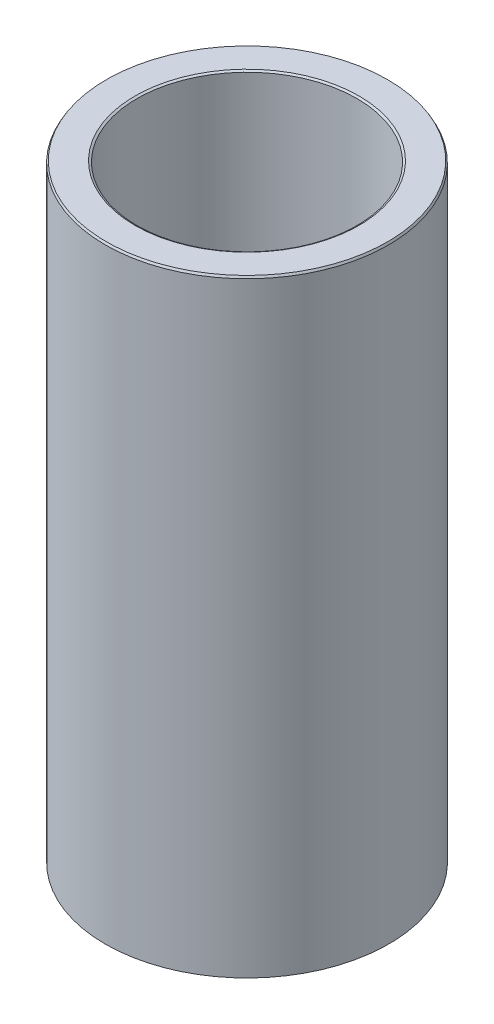
ISO-10303-21;
HEADER;
FILE_DESCRIPTION(('STEP AP214'),'2;1');
FILE_NAME('part.step','',(''),(''),'','','');
FILE_SCHEMA(('AUTOMOTIVE_DESIGN { 1 0 10303 214 1 1 1 1 }'));
ENDSEC;
DATA;
#1=APPLICATION_CONTEXT('core data for automotive mechanical design processes');
#2=APPLICATION_PROTOCOL_DEFINITION('international standard','automotive_design',2000,#1);
#3=PRODUCT_CONTEXT('',#1,'mechanical');
#4=PRODUCT('Part','Part','',(#3));
#5=PRODUCT_RELATED_PRODUCT_CATEGORY('part','',(#4));
#6=PRODUCT_DEFINITION_FORMATION('','',#4);
#7=PRODUCT_DEFINITION_CONTEXT('part definition',#1,'design');
#8=PRODUCT_DEFINITION('design','',#6,#7);
#9=PRODUCT_DEFINITION_SHAPE('','',#8);
#10=(LENGTH_UNIT() NAMED_UNIT(*) SI_UNIT(.MILLI.,.METRE.));
#11=(NAMED_UNIT(*) PLANE_ANGLE_UNIT() SI_UNIT($,.RADIAN.));
#12=(NAMED_UNIT(*) SI_UNIT($,.STERADIAN.) SOLID_ANGLE_UNIT());
#13=UNCERTAINTY_MEASURE_WITH_UNIT(LENGTH_MEASURE(1.E-05),#10,'distance_accuracy_value','');
#14=(GEOMETRIC_REPRESENTATION_CONTEXT(3) GLOBAL_UNCERTAINTY_ASSIGNED_CONTEXT((#13)) GLOBAL_UNIT_ASSIGNED_CONTEXT((#10,
#11,#12)) REPRESENTATION_CONTEXT('',''));
#15=CARTESIAN_POINT('',(0.,0.,0.));
#16=DIRECTION('',(0.,0.,1.));
#17=DIRECTION('',(1.,0.,0.));
#18=AXIS2_PLACEMENT_3D('',#15,#16,#17);
#19=CARTESIAN_POINT('',(0.,64.4296451727049,0.));
#20=DIRECTION('',(0.,-1.,0.));
#21=DIRECTION('',(0.,0.,-1.));
#22=AXIS2_PLACEMENT_3D('',#19,#20,#21);
#23=CYLINDRICAL_SURFACE('',#22,15.);
#24=CARTESIAN_POINT('',(0.,0.125010479312071,0.));
#25=DIRECTION('',(0.,1.,0.));
#26=DIRECTION('',(0.,0.,1.));
#27=AXIS2_PLACEMENT_3D('',#24,#25,#26);
#28=CIRCLE('',#27,15.);
#29=CARTESIAN_POINT('',(0.,0.125010479312071,15.));
#30=VERTEX_POINT('',#29);
#31=EDGE_CURVE('E10',#30,#30,#28,.T.);
#32=ORIENTED_EDGE('',*,*,#31,.T.);
#33=EDGE_LOOP('',(#32));
#34=FACE_BOUND('',#33,.T.);
#35=CARTESIAN_POINT('',(0.,64.2131206710579,0.));
#36=DIRECTION('',(0.,1.,0.));
#37=DIRECTION('',(0.,0.,1.));
#38=AXIS2_PLACEMENT_3D('',#35,#36,#37);
#39=CIRCLE('',#38,15.);
#40=CARTESIAN_POINT('',(0.,64.2131206710579,-15.));
#41=VERTEX_POINT('',#40);
#42=EDGE_CURVE('E50',#41,#41,#39,.F.);
#43=ORIENTED_EDGE('',*,*,#42,.T.);
#44=EDGE_LOOP('',(#43));
#45=FACE_BOUND('',#44,.T.);
#46=ADVANCED_FACE('F39',(#34,#45),#23,.T.);
#47=CARTESIAN_POINT('',(0.,64.4296451727049,0.));
#48=DIRECTION('',(0.,1.,0.));
#49=DIRECTION('',(0.,0.,1.));
#50=AXIS2_PLACEMENT_3D('',#47,#48,#49);
#51=PLANE('',#50);
#52=CARTESIAN_POINT('',(0.,64.4296451727049,0.));
#53=DIRECTION('',(0.,1.,0.));
#54=DIRECTION('',(0.,0.,1.));
#55=AXIS2_PLACEMENT_3D('',#52,#53,#54);
#56=CIRCLE('',#55,11.8623897292429);
#57=CARTESIAN_POINT('',(0.,64.4296451727049,11.8623897292429));
#58=VERTEX_POINT('',#57);
#59=EDGE_CURVE('E58',#58,#58,#56,.F.);
#60=ORIENTED_EDGE('',*,*,#59,.T.);
#61=EDGE_LOOP('',(#60));
#62=FACE_BOUND('',#61,.T.);
#63=CARTESIAN_POINT('',(0.,64.4296451727049,0.));
#64=DIRECTION('',(0.,1.,0.));
#65=DIRECTION('',(0.,0.,1.));
#66=AXIS2_PLACEMENT_3D('',#63,#64,#65);
#67=CIRCLE('',#66,14.8749895206879);
#68=CARTESIAN_POINT('',(0.,64.4296451727049,-14.8749895206879));
#69=VERTEX_POINT('',#68);
#70=EDGE_CURVE('E61',#69,#69,#67,.T.);
#71=ORIENTED_EDGE('',*,*,#70,.T.);
#72=EDGE_LOOP('',(#71));
#73=FACE_BOUND('',#72,.T.);
#74=ADVANCED_FACE('F88',(#62,#73),#51,.T.);
#75=CARTESIAN_POINT('',(0.,0.,0.));
#76=DIRECTION('',(0.,1.,0.));
#77=DIRECTION('',(0.,0.,1.));
#78=AXIS2_PLACEMENT_3D('',#75,#76,#77);
#79=PLANE('',#78);
#80=CARTESIAN_POINT('',(0.,0.,0.));
#81=DIRECTION('',(0.,1.,0.));
#82=DIRECTION('',(0.,0.,1.));
#83=AXIS2_PLACEMENT_3D('',#80,#81,#82);
#84=CIRCLE('',#83,11.7708757069079);
#85=CARTESIAN_POINT('',(0.,0.,-11.7708757069079));
#86=VERTEX_POINT('',#85);
#87=EDGE_CURVE('E51',#86,#86,#84,.T.);
#88=ORIENTED_EDGE('',*,*,#87,.T.);
#89=EDGE_LOOP('',(#88));
#90=FACE_BOUND('',#89,.T.);
#91=CARTESIAN_POINT('',(0.,0.,0.));
#92=DIRECTION('',(0.,1.,0.));
#93=DIRECTION('',(0.,0.,1.));
#94=AXIS2_PLACEMENT_3D('',#91,#92,#93);
#95=CIRCLE('',#94,14.783475498353);
#96=CARTESIAN_POINT('',(0.,0.,14.783475498353));
#97=VERTEX_POINT('',#96);
#98=EDGE_CURVE('E54',#97,#97,#95,.F.);
#99=ORIENTED_EDGE('',*,*,#98,.T.);
#100=EDGE_LOOP('',(#99));
#101=FACE_BOUND('',#100,.T.);
#102=ADVANCED_FACE('F83',(#90,#101),#79,.F.);
#103=CARTESIAN_POINT('',(0.,64.4296451727049,0.));
#104=DIRECTION('',(0.,-1.,0.));
#105=DIRECTION('',(0.,0.,-1.));
#106=AXIS2_PLACEMENT_3D('',#103,#104,#105);
#107=CYLINDRICAL_SURFACE('',#106,11.6458652275958);
#108=CARTESIAN_POINT('',(0.,64.3046346933928,0.));
#109=DIRECTION('',(0.,1.,0.));
#110=DIRECTION('',(0.,0.,1.));
#111=AXIS2_PLACEMENT_3D('',#108,#109,#110);
#112=CIRCLE('',#111,11.6458652275958);
#113=CARTESIAN_POINT('',(0.,64.3046346933928,11.6458652275958));
#114=VERTEX_POINT('',#113);
#115=EDGE_CURVE('E67',#114,#114,#112,.T.);
#116=ORIENTED_EDGE('',*,*,#115,.T.);
#117=EDGE_LOOP('',(#116));
#118=FACE_BOUND('',#117,.T.);
#119=CARTESIAN_POINT('',(0.,0.216524501647053,0.));
#120=DIRECTION('',(0.,1.,0.));
#121=DIRECTION('',(0.,0.,1.));
#122=AXIS2_PLACEMENT_3D('',#119,#120,#121);
#123=CIRCLE('',#122,11.6458652275958);
#124=CARTESIAN_POINT('',(0.,0.216524501647053,-11.6458652275958));
#125=VERTEX_POINT('',#124);
#126=EDGE_CURVE('E69',#125,#125,#123,.F.);
#127=ORIENTED_EDGE('',*,*,#126,.T.);
#128=EDGE_LOOP('',(#127));
#129=FACE_BOUND('',#128,.T.);
#130=ADVANCED_FACE('F71',(#118,#129),#107,.F.);
#131=CARTESIAN_POINT('',(0.,64.3046346933928,0.));
#132=DIRECTION('',(0.,1.,0.));
#133=DIRECTION('',(0.,0.,1.));
#134=AXIS2_PLACEMENT_3D('',#131,#132,#133);
#135=CONICAL_SURFACE('',#134,11.6458652275958,1.04719755119657);
#136=ORIENTED_EDGE('',*,*,#59,.F.);
#137=EDGE_LOOP('',(#136));
#138=FACE_BOUND('',#137,.T.);
#139=ORIENTED_EDGE('',*,*,#115,.F.);
#140=EDGE_LOOP('',(#139));
#141=FACE_BOUND('',#140,.T.);
#142=ADVANCED_FACE('F77',(#138,#141),#135,.F.);
#143=CARTESIAN_POINT('',(0.,0.,0.));
#144=DIRECTION('',(0.,-1.,0.));
#145=DIRECTION('',(0.,0.,-1.));
#146=AXIS2_PLACEMENT_3D('',#143,#144,#145);
#147=CONICAL_SURFACE('',#146,11.7708757069079,0.523598775598295);
#148=CARTESIAN_POINT('',(0.,0.216524501647053,-11.6458652275958));
#149=CARTESIAN_POINT('',(0.,0.214269038088229,-11.6471674200887));
#150=CARTESIAN_POINT('',(0.,0.212013574529406,-11.6484696125815));
#151=CARTESIAN_POINT('',(0.,0.207502647411759,-11.6510739975672));
#152=CARTESIAN_POINT('',(0.,0.205247183852936,-11.65237619006));
#153=CARTESIAN_POINT('',(0.,0.200736256735289,-11.6549805750457));
#154=CARTESIAN_POINT('',(0.,0.198480793176465,-11.6562827675385));
#155=CARTESIAN_POINT('',(0.,0.193969866058818,-11.6588871525242));
#156=CARTESIAN_POINT('',(0.,0.191714402499995,-11.660189345017));
#157=CARTESIAN_POINT('',(0.,0.187203475382348,-11.6627937300027));
#158=CARTESIAN_POINT('',(0.,0.184948011823524,-11.6640959224955));
#159=CARTESIAN_POINT('',(0.,0.180437084705877,-11.6667003074812));
#160=CARTESIAN_POINT('',(0.,0.178181621147054,-11.668002499974));
#161=CARTESIAN_POINT('',(0.,0.173670694029407,-11.6706068849597));
#162=CARTESIAN_POINT('',(0.,0.171415230470584,-11.6719090774525));
#163=CARTESIAN_POINT('',(0.,0.166904303352937,-11.6745134624382));
#164=CARTESIAN_POINT('',(0.,0.164648839794113,-11.675815654931));
#165=CARTESIAN_POINT('',(0.,0.160137912676466,-11.6784200399167));
#166=CARTESIAN_POINT('',(0.,0.157882449117643,-11.6797222324095));
#167=CARTESIAN_POINT('',(0.,0.153371521999996,-11.6823266173952));
#168=CARTESIAN_POINT('',(0.,0.151116058441172,-11.683628809888));
#169=CARTESIAN_POINT('',(0.,0.146605131323525,-11.6862331948737));
#170=CARTESIAN_POINT('',(0.,0.144349667764702,-11.6875353873665));
#171=CARTESIAN_POINT('',(0.,0.139838740647055,-11.6901397723522));
#172=CARTESIAN_POINT('',(0.,0.137583277088232,-11.691441964845));
#173=CARTESIAN_POINT('',(0.,0.133072349970585,-11.6940463498307));
#174=CARTESIAN_POINT('',(0.,0.130816886411761,-11.6953485423235));
#175=CARTESIAN_POINT('',(0.,0.126305959294114,-11.6979529273092));
#176=CARTESIAN_POINT('',(0.,0.124050495735291,-11.699255119802));
#177=CARTESIAN_POINT('',(0.,0.119539568617644,-11.7018595047877));
#178=CARTESIAN_POINT('',(0.,0.11728410505882,-11.7031616972805));
#179=CARTESIAN_POINT('',(0.,0.112773177941173,-11.7057660822662));
#180=CARTESIAN_POINT('',(0.,0.11051771438235,-11.707068274759));
#181=CARTESIAN_POINT('',(0.,0.106006787264703,-11.7096726597447));
#182=CARTESIAN_POINT('',(0.,0.10375132370588,-11.7109748522375));
#183=CARTESIAN_POINT('',(0.,0.0992403965882326,-11.7135792372232));
#184=CARTESIAN_POINT('',(0.,0.0969849330294091,-11.7148814297161));
#185=CARTESIAN_POINT('',(0.,0.0924740059117622,-11.7174858147017));
#186=CARTESIAN_POINT('',(0.,0.0902185423529387,-11.7187880071946));
#187=CARTESIAN_POINT('',(0.,0.0857076152352918,-11.7213923921802));
#188=CARTESIAN_POINT('',(0.,0.0834521516764683,-11.7226945846731));
#189=CARTESIAN_POINT('',(0.,0.0789412245588214,-11.7252989696587));
#190=CARTESIAN_POINT('',(0.,0.0766857609999979,-11.7266011621516));
#191=CARTESIAN_POINT('',(0.,0.072174833882351,-11.7292055471372));
#192=CARTESIAN_POINT('',(0.,0.0699193703235275,-11.7305077396301));
#193=CARTESIAN_POINT('',(0.,0.0654084432058805,-11.7331121246157));
#194=CARTESIAN_POINT('',(0.,0.0631529796470569,-11.7344143171086));
#195=CARTESIAN_POINT('',(0.,0.0586420525294101,-11.7370187020942));
#196=CARTESIAN_POINT('',(0.,0.0563865889705868,-11.7383208945871));
#197=CARTESIAN_POINT('',(0.,0.0518756618529399,-11.7409252795727));
#198=CARTESIAN_POINT('',(0.,0.0496201982941163,-11.7422274720656));
#199=CARTESIAN_POINT('',(0.,0.0451092711764693,-11.7448318570512));
#200=CARTESIAN_POINT('',(0.,0.0428538076176459,-11.7461340495441));
#201=CARTESIAN_POINT('',(0.,0.038342880499999,-11.7487384345297));
#202=CARTESIAN_POINT('',(0.,0.0360874169411755,-11.7500406270226));
#203=CARTESIAN_POINT('',(0.,0.0315764898235285,-11.7526450120082));
#204=CARTESIAN_POINT('',(0.,0.0293210262647051,-11.7539472045011));
#205=CARTESIAN_POINT('',(0.,0.0248100991470581,-11.7565515894867));
#206=CARTESIAN_POINT('',(0.,0.0225546355882347,-11.7578537819796));
#207=CARTESIAN_POINT('',(0.,0.0180437084705877,-11.7604581669652));
#208=CARTESIAN_POINT('',(0.,0.0157882449117643,-11.7617603594581));
#209=CARTESIAN_POINT('',(0.,0.0112773177941173,-11.7643647444437));
#210=CARTESIAN_POINT('',(0.,0.00902185423529387,-11.7656669369366));
#211=CARTESIAN_POINT('',(0.,0.00451092711764694,-11.7682713219222));
#212=CARTESIAN_POINT('',(0.,0.00225546355882347,-11.7695735144151));
#213=CARTESIAN_POINT('',(0.,0.,-11.7708757069079));
#214=B_SPLINE_CURVE_WITH_KNOTS('',3,(#148,#149,#150,#151,#152,#153,#154,#155,#156,#157,#158,
#159,#160,#161,#162,#163,#164,#165,#166,#167,#168,#169,#170,#171,#172,#173,#174,#175,#176,#177,
#178,#179,#180,#181,#182,#183,#184,#185,#186,#187,#188,#189,#190,#191,#192,#193,#194,#195,#196,
#197,#198,#199,#200,#201,#202,#203,#204,#205,#206,#207,#208,#209,#210,#211,#212,#213),
.UNSPECIFIED.,.F.,.F.,(4,2,2,2,2,2,2,2,2,2,2,2,2,2,2,2,2,2,2,2,2,2,2,2,2,2,2,2,2,2,2,2,4),(0.,
0.00781315495700465,0.0156263099140093,0.023439464871014,0.0312526198280186,0.0390657747850233,
0.0468789297420279,0.0546920846990326,0.0625052396560372,0.0703183946130427,0.0781315495700474,
0.085944704527052,0.0937578594840567,0.101571014441061,0.109384169398066,0.117197324355071,
0.125010479312075,0.13282363426908,0.140636789226085,0.148449944183089,0.156263099140094,
0.164076254097099,0.171889409054103,0.179702564011108,0.187515718968113,0.195328873925118,
0.203142028882123,0.210955183839127,0.218768338796132,0.226581493753137,0.234394648710141,
0.242207803667146,0.250020958624151),.UNSPECIFIED.);
#215=EDGE_CURVE('BSEAM73',#125,#86,#214,.T.);
#216=ORIENTED_EDGE('',*,*,#126,.F.);
#217=ORIENTED_EDGE('',*,*,#87,.F.);
#218=ORIENTED_EDGE('',*,*,#215,.T.);
#219=ORIENTED_EDGE('',*,*,#215,.F.);
#220=EDGE_LOOP('',(#216,#218,#217,#219));
#221=FACE_BOUND('',#220,.T.);
#222=ADVANCED_FACE('F73',(#221),#147,.F.);
#223=CARTESIAN_POINT('',(0.,0.125010479312071,0.));
#224=DIRECTION('',(0.,1.,0.));
#225=DIRECTION('',(0.,0.,1.));
#226=AXIS2_PLACEMENT_3D('',#223,#224,#225);
#227=CONICAL_SURFACE('',#226,15.,1.04719755119659);
#228=ORIENTED_EDGE('',*,*,#98,.F.);
#229=EDGE_LOOP('',(#228));
#230=FACE_BOUND('',#229,.T.);
#231=ORIENTED_EDGE('',*,*,#31,.F.);
#232=EDGE_LOOP('',(#231));
#233=FACE_BOUND('',#232,.T.);
#234=ADVANCED_FACE('F76',(#230,#233),#227,.T.);
#235=CARTESIAN_POINT('',(0.,64.4296451727049,0.));
#236=DIRECTION('',(0.,-1.,0.));
#237=DIRECTION('',(0.,0.,-1.));
#238=AXIS2_PLACEMENT_3D('',#235,#236,#237);
#239=CONICAL_SURFACE('',#238,14.8749895206879,0.523598775598307);
#240=CARTESIAN_POINT('',(0.,64.2131206710579,-15.));
#241=CARTESIAN_POINT('',(0.,64.2153761346167,-14.9986978075072));
#242=CARTESIAN_POINT('',(0.,64.2176315981755,-14.9973956150143));
#243=CARTESIAN_POINT('',(0.,64.2221425252932,-14.9947912300287));
#244=CARTESIAN_POINT('',(0.,64.224397988852,-14.9934890375358));
#245=CARTESIAN_POINT('',(0.,64.2289089159696,-14.9908846525502));
#246=CARTESIAN_POINT('',(0.,64.2311643795284,-14.9895824600573));
#247=CARTESIAN_POINT('',(0.,64.2356753066461,-14.9869780750717));
#248=CARTESIAN_POINT('',(0.,64.2379307702049,-14.9856758825788));
#249=CARTESIAN_POINT('',(0.,64.2424416973226,-14.9830714975932));
#250=CARTESIAN_POINT('',(0.,64.2446971608814,-14.9817693051003));
#251=CARTESIAN_POINT('',(0.,64.249208087999,-14.9791649201147));
#252=CARTESIAN_POINT('',(0.,64.2514635515578,-14.9778627276218));
#253=CARTESIAN_POINT('',(0.,64.2559744786755,-14.9752583426362));
#254=CARTESIAN_POINT('',(0.,64.2582299422343,-14.9739561501433));
#255=CARTESIAN_POINT('',(0.,64.262740869352,-14.9713517651577));
#256=CARTESIAN_POINT('',(0.,64.2649963329108,-14.9700495726648));
#257=CARTESIAN_POINT('',(0.,64.2695072600284,-14.9674451876792));
#258=CARTESIAN_POINT('',(0.,64.2717627235873,-14.9661429951863));
#259=CARTESIAN_POINT('',(0.,64.2762736507049,-14.9635386102006));
#260=CARTESIAN_POINT('',(0.,64.2785291142637,-14.9622364177078));
#261=CARTESIAN_POINT('',(0.,64.2830400413814,-14.9596320327221));
#262=CARTESIAN_POINT('',(0.,64.2852955049402,-14.9583298402293));
#263=CARTESIAN_POINT('',(0.,64.2898064320579,-14.9557254552436));
#264=CARTESIAN_POINT('',(0.,64.2920618956167,-14.9544232627508));
#265=CARTESIAN_POINT('',(0.,64.2965728227343,-14.9518188777651));
#266=CARTESIAN_POINT('',(0.,64.2988282862931,-14.9505166852723));
#267=CARTESIAN_POINT('',(0.,64.3033392134108,-14.9479123002866));
#268=CARTESIAN_POINT('',(0.,64.3055946769696,-14.9466101077938));
#269=CARTESIAN_POINT('',(0.,64.3101056040873,-14.9440057228081));
#270=CARTESIAN_POINT('',(0.,64.3123610676461,-14.9427035303153));
#271=CARTESIAN_POINT('',(0.,64.3168719947637,-14.9400991453296));
#272=CARTESIAN_POINT('',(0.,64.3191274583226,-14.9387969528368));
#273=CARTESIAN_POINT('',(0.,64.3236383854402,-14.9361925678511));
#274=CARTESIAN_POINT('',(0.,64.325893848999,-14.9348903753583));
#275=CARTESIAN_POINT('',(0.,64.3304047761167,-14.9322859903726));
#276=CARTESIAN_POINT('',(0.,64.3326602396755,-14.9309837978798));
#277=CARTESIAN_POINT('',(0.,64.3371711667931,-14.9283794128941));
#278=CARTESIAN_POINT('',(0.,64.339426630352,-14.9270772204013));
#279=CARTESIAN_POINT('',(0.,64.3439375574696,-14.9244728354156));
#280=CARTESIAN_POINT('',(0.,64.3461930210284,-14.9231706429228));
#281=CARTESIAN_POINT('',(0.,64.3507039481461,-14.9205662579371));
#282=CARTESIAN_POINT('',(0.,64.3529594117049,-14.9192640654443));
#283=CARTESIAN_POINT('',(0.,64.3574703388226,-14.9166596804586));
#284=CARTESIAN_POINT('',(0.,64.3597258023814,-14.9153574879658));
#285=CARTESIAN_POINT('',(0.,64.364236729499,-14.9127531029801));
#286=CARTESIAN_POINT('',(0.,64.3664921930579,-14.9114509104873));
#287=CARTESIAN_POINT('',(0.,64.3710031201755,-14.9088465255016));
#288=CARTESIAN_POINT('',(0.,64.3732585837343,-14.9075443330088));
#289=CARTESIAN_POINT('',(0.,64.377769510852,-14.9049399480231));
#290=CARTESIAN_POINT('',(0.,64.3800249744108,-14.9036377555303));
#291=CARTESIAN_POINT('',(0.,64.3845359015284,-14.9010333705446));
#292=CARTESIAN_POINT('',(0.,64.3867913650873,-14.8997311780518));
#293=CARTESIAN_POINT('',(0.,64.3913022922049,-14.8971267930661));
#294=CARTESIAN_POINT('',(0.,64.3935577557637,-14.8958246005733));
#295=CARTESIAN_POINT('',(0.,64.3980686828814,-14.8932202155876));
#296=CARTESIAN_POINT('',(0.,64.4003241464402,-14.8919180230948));
#297=CARTESIAN_POINT('',(0.,64.4048350735578,-14.8893136381091));
#298=CARTESIAN_POINT('',(0.,64.4070905371167,-14.8880114456163));
#299=CARTESIAN_POINT('',(0.,64.4116014642343,-14.8854070606306));
#300=CARTESIAN_POINT('',(0.,64.4138569277931,-14.8841048681378));
#301=CARTESIAN_POINT('',(0.,64.4183678549108,-14.8815004831521));
#302=CARTESIAN_POINT('',(0.,64.4206233184696,-14.8801982906593));
#303=CARTESIAN_POINT('',(0.,64.4251342455873,-14.8775939056736));
#304=CARTESIAN_POINT('',(0.,64.4273897091461,-14.8762917131808));
#305=CARTESIAN_POINT('',(0.,64.4296451727049,-14.8749895206879));
#306=B_SPLINE_CURVE_WITH_KNOTS('',3,(#240,#241,#242,#243,#244,#245,#246,#247,#248,#249,#250,
#251,#252,#253,#254,#255,#256,#257,#258,#259,#260,#261,#262,#263,#264,#265,#266,#267,#268,#269,
#270,#271,#272,#273,#274,#275,#276,#277,#278,#279,#280,#281,#282,#283,#284,#285,#286,#287,#288,
#289,#290,#291,#292,#293,#294,#295,#296,#297,#298,#299,#300,#301,#302,#303,#304,#305),
.UNSPECIFIED.,.F.,.F.,(4,2,2,2,2,2,2,2,2,2,2,2,2,2,2,2,2,2,2,2,2,2,2,2,2,2,2,2,2,2,2,2,4),(0.,
0.00781315495701517,0.0156263099140183,0.0234394648710215,0.0312526198280246,0.0390657747850278,
0.0468789297420309,0.0546920846990349,0.0625052396560381,0.0703183946130533,0.0781315495700564,
0.0859447045270595,0.0937578594840627,0.101571014441066,0.109384169398069,0.117197324355073,
0.125010479312076,0.132823634269091,0.140636789226094,0.148449944183098,0.156263099140101,
0.164076254097104,0.171889409054107,0.179702564011111,0.187515718968126,0.195328873925129,
0.203142028882132,0.210955183839136,0.218768338796139,0.226581493753142,0.234394648710145,
0.242207803667149,0.250020958624164),.UNSPECIFIED.);
#307=EDGE_CURVE('BSEAM45',#41,#69,#306,.T.);
#308=ORIENTED_EDGE('',*,*,#42,.F.);
#309=ORIENTED_EDGE('',*,*,#70,.F.);
#310=ORIENTED_EDGE('',*,*,#307,.T.);
#311=ORIENTED_EDGE('',*,*,#307,.F.);
#312=EDGE_LOOP('',(#308,#310,#309,#311));
#313=FACE_BOUND('',#312,.T.);
#314=ADVANCED_FACE('F45',(#313),#239,.T.);
#315=CLOSED_SHELL('',(#46,#74,#102,#130,#142,#222,#234,#314));
#316=MANIFOLD_SOLID_BREP('B2',#315);
#317=ADVANCED_BREP_SHAPE_REPRESENTATION('',(#18,#316),#14);
#318=SHAPE_DEFINITION_REPRESENTATION(#9,#317);
ENDSEC;
END-ISO-10303-21;
